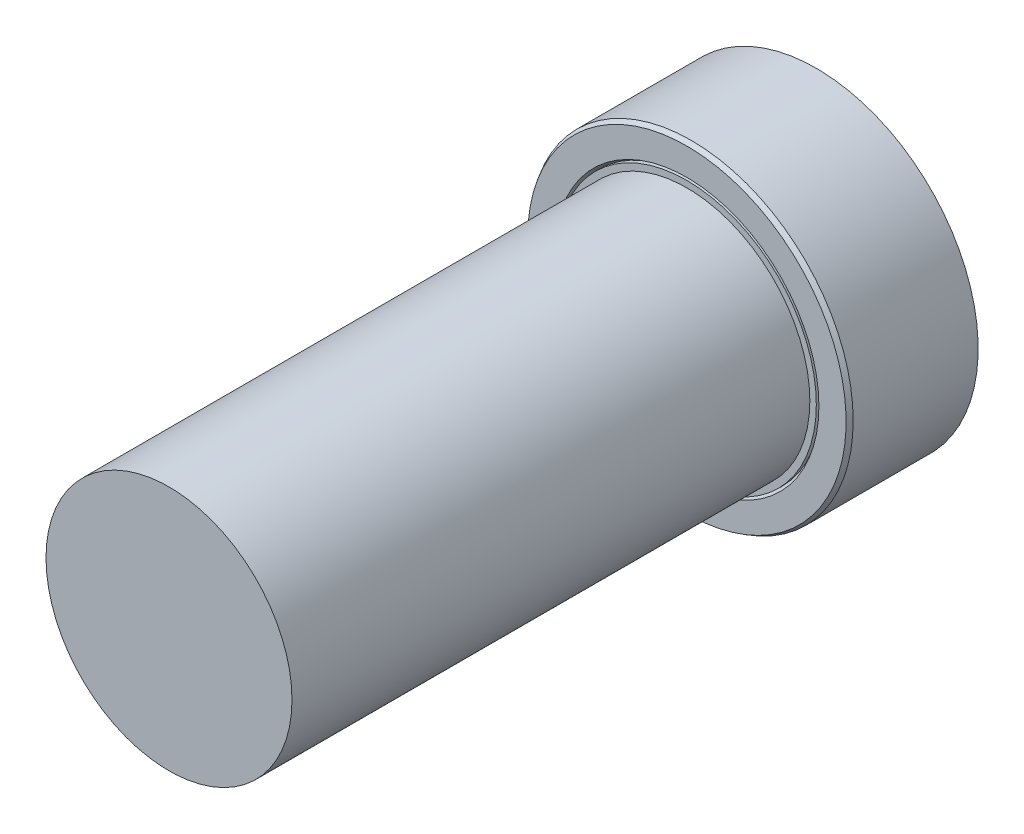
ISO-10303-21;
HEADER;
FILE_DESCRIPTION(('STEP AP214'),'2;1');
FILE_NAME('part.step','',(''),(''),'','','');
FILE_SCHEMA(('AUTOMOTIVE_DESIGN { 1 0 10303 214 1 1 1 1 }'));
ENDSEC;
DATA;
#1=APPLICATION_CONTEXT('core data for automotive mechanical design processes');
#2=APPLICATION_PROTOCOL_DEFINITION('international standard','automotive_design',2000,#1);
#3=PRODUCT_CONTEXT('',#1,'mechanical');
#4=PRODUCT('Part','Part','',(#3));
#5=PRODUCT_RELATED_PRODUCT_CATEGORY('part','',(#4));
#6=PRODUCT_DEFINITION_FORMATION('','',#4);
#7=PRODUCT_DEFINITION_CONTEXT('part definition',#1,'design');
#8=PRODUCT_DEFINITION('design','',#6,#7);
#9=PRODUCT_DEFINITION_SHAPE('','',#8);
#10=(LENGTH_UNIT() NAMED_UNIT(*) SI_UNIT(.MILLI.,.METRE.));
#11=(NAMED_UNIT(*) PLANE_ANGLE_UNIT() SI_UNIT($,.RADIAN.));
#12=(NAMED_UNIT(*) SI_UNIT($,.STERADIAN.) SOLID_ANGLE_UNIT());
#13=UNCERTAINTY_MEASURE_WITH_UNIT(LENGTH_MEASURE(1.E-05),#10,'distance_accuracy_value','');
#14=(GEOMETRIC_REPRESENTATION_CONTEXT(3) GLOBAL_UNCERTAINTY_ASSIGNED_CONTEXT((#13)) GLOBAL_UNIT_ASSIGNED_CONTEXT((#10,
#11,#12)) REPRESENTATION_CONTEXT('',''));
#15=CARTESIAN_POINT('',(0.,0.,0.));
#16=DIRECTION('',(0.,0.,1.));
#17=DIRECTION('',(1.,0.,0.));
#18=AXIS2_PLACEMENT_3D('',#15,#16,#17);
#19=CARTESIAN_POINT('',(0.,0.,1.22591498133671));
#20=DIRECTION('',(0.,0.,-1.));
#21=DIRECTION('',(-1.,0.,0.));
#22=AXIS2_PLACEMENT_3D('',#19,#20,#21);
#23=PLANE('',#22);
#24=CARTESIAN_POINT('',(0.,0.,1.22591498133671));
#25=DIRECTION('',(0.,0.,-1.));
#26=DIRECTION('',(-1.,0.,0.));
#27=AXIS2_PLACEMENT_3D('',#24,#25,#26);
#28=CIRCLE('',#27,6.25);
#29=CARTESIAN_POINT('',(-6.25,0.,1.22591498133671));
#30=VERTEX_POINT('',#29);
#31=EDGE_CURVE('E37',#30,#30,#28,.F.);
#32=ORIENTED_EDGE('',*,*,#31,.F.);
#33=EDGE_LOOP('',(#32));
#34=FACE_BOUND('',#33,.T.);
#35=ADVANCED_FACE('F34',(#34),#23,.T.);
#36=CARTESIAN_POINT('',(0.,0.,6.47591498133671));
#37=DIRECTION('',(0.,0.,-1.));
#38=DIRECTION('',(-1.,0.,0.));
#39=AXIS2_PLACEMENT_3D('',#36,#37,#38);
#40=CYLINDRICAL_SURFACE('',#39,6.25);
#41=ORIENTED_EDGE('',*,*,#31,.T.);
#42=EDGE_LOOP('',(#41));
#43=FACE_BOUND('',#42,.T.);
#44=CARTESIAN_POINT('',(0.,0.,6.0527099005798));
#45=DIRECTION('',(0.,0.,-1.));
#46=DIRECTION('',(1.,0.,0.));
#47=AXIS2_PLACEMENT_3D('',#44,#45,#46);
#48=CIRCLE('',#47,6.24999999999999);
#49=CARTESIAN_POINT('',(6.24999999999999,0.,6.0527099005798));
#50=VERTEX_POINT('',#49);
#51=EDGE_CURVE('E49',#50,#50,#48,.F.);
#52=ORIENTED_EDGE('',*,*,#51,.F.);
#53=EDGE_LOOP('',(#52));
#54=FACE_BOUND('',#53,.T.);
#55=ADVANCED_FACE('F67',(#43,#54),#40,.T.);
#56=CARTESIAN_POINT('',(0.,0.,6.0527099005798));
#57=DIRECTION('',(0.,0.,-1.));
#58=DIRECTION('',(-1.,0.,0.));
#59=AXIS2_PLACEMENT_3D('',#56,#57,#58);
#60=CONICAL_SURFACE('',#59,6.25,0.5235987755982);
#61=ORIENTED_EDGE('',*,*,#51,.T.);
#62=EDGE_LOOP('',(#61));
#63=FACE_BOUND('',#62,.T.);
#64=CARTESIAN_POINT('',(0.,0.,6.22591498133671));
#65=DIRECTION('',(0.,0.,-1.));
#66=DIRECTION('',(-1.,0.,0.));
#67=AXIS2_PLACEMENT_3D('',#64,#65,#66);
#68=CIRCLE('',#67,6.15000000000001);
#69=CARTESIAN_POINT('',(-6.15000000000001,0.,6.22591498133671));
#70=VERTEX_POINT('',#69);
#71=EDGE_CURVE('E57',#70,#70,#68,.T.);
#72=ORIENTED_EDGE('',*,*,#71,.T.);
#73=EDGE_LOOP('',(#72));
#74=FACE_BOUND('',#73,.T.);
#75=ADVANCED_FACE('F74',(#63,#74),#60,.T.);
#76=CARTESIAN_POINT('',(0.,0.,6.22591498133671));
#77=DIRECTION('',(0.,0.,-1.));
#78=DIRECTION('',(-1.,0.,0.));
#79=AXIS2_PLACEMENT_3D('',#76,#77,#78);
#80=PLANE('',#79);
#81=CARTESIAN_POINT('',(0.,0.,6.22591498133671));
#82=DIRECTION('',(0.,0.,1.));
#83=DIRECTION('',(1.,0.,0.));
#84=AXIS2_PLACEMENT_3D('',#81,#82,#83);
#85=CIRCLE('',#84,5.09999999999999);
#86=CARTESIAN_POINT('',(5.09999999999999,0.,6.22591498133671));
#87=VERTEX_POINT('',#86);
#88=EDGE_CURVE('E55',#87,#87,#85,.F.);
#89=ORIENTED_EDGE('',*,*,#88,.T.);
#90=EDGE_LOOP('',(#89));
#91=FACE_BOUND('',#90,.T.);
#92=ORIENTED_EDGE('',*,*,#71,.F.);
#93=EDGE_LOOP('',(#92));
#94=FACE_BOUND('',#93,.T.);
#95=ADVANCED_FACE('F97',(#91,#94),#80,.F.);
#96=CARTESIAN_POINT('',(0.,0.,6.22591498133671));
#97=DIRECTION('',(0.,0.,1.));
#98=DIRECTION('',(1.,0.,0.));
#99=AXIS2_PLACEMENT_3D('',#96,#97,#98);
#100=CONICAL_SURFACE('',#99,5.09999999999999,0.523598775598199);
#101=ORIENTED_EDGE('',*,*,#88,.F.);
#102=EDGE_LOOP('',(#101));
#103=FACE_BOUND('',#102,.T.);
#104=CARTESIAN_POINT('',(0.,0.,6.05270990057986));
#105=DIRECTION('',(0.,0.,-1.));
#106=DIRECTION('',(-1.,0.,0.));
#107=AXIS2_PLACEMENT_3D('',#104,#105,#106);
#108=CIRCLE('',#107,5.);
#109=CARTESIAN_POINT('',(-5.,0.,6.05270990057986));
#110=VERTEX_POINT('',#109);
#111=EDGE_CURVE('E54',#110,#110,#108,.F.);
#112=ORIENTED_EDGE('',*,*,#111,.F.);
#113=EDGE_LOOP('',(#112));
#114=FACE_BOUND('',#113,.T.);
#115=ADVANCED_FACE('F93',(#103,#114),#100,.F.);
#116=CARTESIAN_POINT('',(0.,0.,27.4759149813367));
#117=DIRECTION('',(0.,0.,-1.));
#118=DIRECTION('',(-1.,0.,0.));
#119=AXIS2_PLACEMENT_3D('',#116,#117,#118);
#120=CYLINDRICAL_SURFACE('',#119,5.);
#121=CARTESIAN_POINT('',(0.,0.,6.22591498133671));
#122=DIRECTION('',(0.,0.,-1.));
#123=DIRECTION('',(-1.,0.,0.));
#124=AXIS2_PLACEMENT_3D('',#121,#122,#123);
#125=CIRCLE('',#124,5.);
#126=CARTESIAN_POINT('',(-5.,0.,6.22591498133671));
#127=VERTEX_POINT('',#126);
#128=EDGE_CURVE('E46',#127,#127,#125,.T.);
#129=ORIENTED_EDGE('',*,*,#128,.T.);
#130=EDGE_LOOP('',(#129));
#131=FACE_BOUND('',#130,.T.);
#132=ORIENTED_EDGE('',*,*,#111,.T.);
#133=EDGE_LOOP('',(#132));
#134=FACE_BOUND('',#133,.T.);
#135=ADVANCED_FACE('F89',(#131,#134),#120,.T.);
#136=CARTESIAN_POINT('',(0.,0.,6.22591498133671));
#137=DIRECTION('',(0.,0.,-1.));
#138=DIRECTION('',(-1.,0.,0.));
#139=AXIS2_PLACEMENT_3D('',#136,#137,#138);
#140=PLANE('',#139);
#141=CARTESIAN_POINT('',(0.,0.,6.22591498133671));
#142=DIRECTION('',(0.,0.,-1.));
#143=DIRECTION('',(-1.,0.,0.));
#144=AXIS2_PLACEMENT_3D('',#141,#142,#143);
#145=CIRCLE('',#144,4.75);
#146=CARTESIAN_POINT('',(-4.75,0.,6.22591498133671));
#147=VERTEX_POINT('',#146);
#148=EDGE_CURVE('E41',#147,#147,#145,.F.);
#149=ORIENTED_EDGE('',*,*,#148,.F.);
#150=EDGE_LOOP('',(#149));
#151=FACE_BOUND('',#150,.T.);
#152=ORIENTED_EDGE('',*,*,#128,.F.);
#153=EDGE_LOOP('',(#152));
#154=FACE_BOUND('',#153,.T.);
#155=ADVANCED_FACE('F82',(#151,#154),#140,.F.);
#156=CARTESIAN_POINT('',(0.,0.,26.2259149813367));
#157=DIRECTION('',(0.,0.,-1.));
#158=DIRECTION('',(-1.,0.,0.));
#159=AXIS2_PLACEMENT_3D('',#156,#157,#158);
#160=PLANE('',#159);
#161=CARTESIAN_POINT('',(0.,0.,26.2259149813367));
#162=DIRECTION('',(0.,0.,-1.));
#163=DIRECTION('',(-1.,0.,0.));
#164=AXIS2_PLACEMENT_3D('',#161,#162,#163);
#165=CIRCLE('',#164,4.75);
#166=CARTESIAN_POINT('',(-4.75,0.,26.2259149813367));
#167=VERTEX_POINT('',#166);
#168=EDGE_CURVE('E10',#167,#167,#165,.T.);
#169=ORIENTED_EDGE('',*,*,#168,.F.);
#170=EDGE_LOOP('',(#169));
#171=FACE_BOUND('',#170,.T.);
#172=ADVANCED_FACE('F77',(#171),#160,.F.);
#173=CARTESIAN_POINT('',(0.,0.,27.4759149813367));
#174=DIRECTION('',(0.,0.,-1.));
#175=DIRECTION('',(-1.,0.,0.));
#176=AXIS2_PLACEMENT_3D('',#173,#174,#175);
#177=CYLINDRICAL_SURFACE('',#176,4.75);
#178=ORIENTED_EDGE('',*,*,#168,.T.);
#179=EDGE_LOOP('',(#178));
#180=FACE_BOUND('',#179,.T.);
#181=ORIENTED_EDGE('',*,*,#148,.T.);
#182=EDGE_LOOP('',(#181));
#183=FACE_BOUND('',#182,.T.);
#184=ADVANCED_FACE('F75',(#180,#183),#177,.T.);
#185=CLOSED_SHELL('',(#35,#55,#75,#95,#115,#135,#155,#172,#184));
#186=MANIFOLD_SOLID_BREP('B2',#185);
#187=ADVANCED_BREP_SHAPE_REPRESENTATION('',(#18,#186),#14);
#188=SHAPE_DEFINITION_REPRESENTATION(#9,#187);
ENDSEC;
END-ISO-10303-21;
